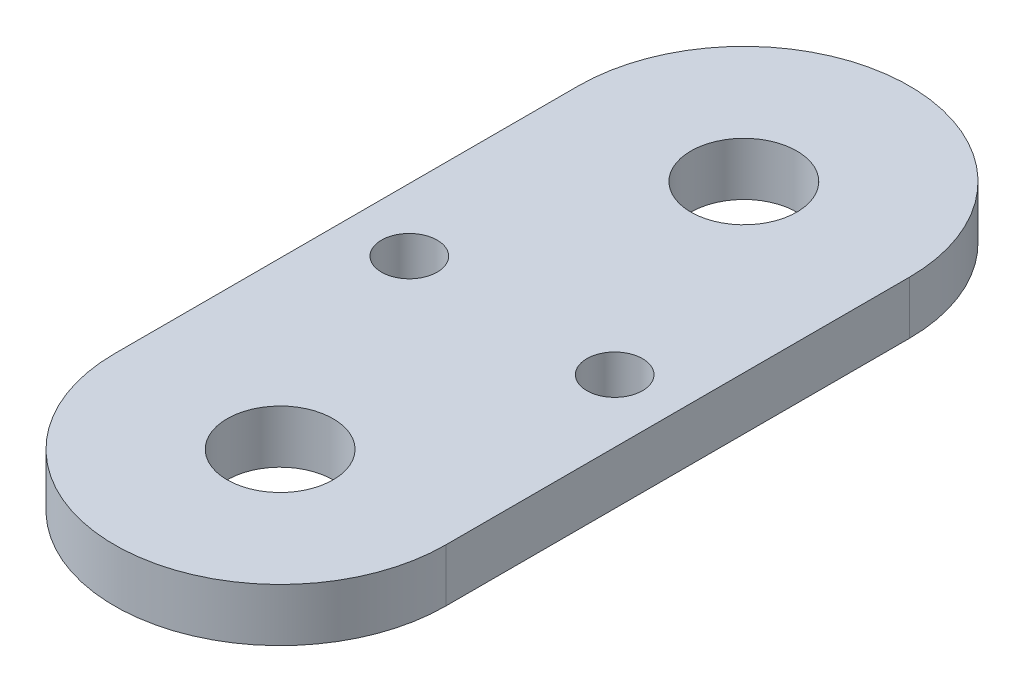
ISO-10303-21;
HEADER;
FILE_DESCRIPTION(('STEP AP214'),'2;1');
FILE_NAME('part.step','',(''),(''),'','','');
FILE_SCHEMA(('AUTOMOTIVE_DESIGN { 1 0 10303 214 1 1 1 1 }'));
ENDSEC;
DATA;
#1=APPLICATION_CONTEXT('core data for automotive mechanical design processes');
#2=APPLICATION_PROTOCOL_DEFINITION('international standard','automotive_design',2000,#1);
#3=PRODUCT_CONTEXT('',#1,'mechanical');
#4=PRODUCT('Part','Part','',(#3));
#5=PRODUCT_RELATED_PRODUCT_CATEGORY('part','',(#4));
#6=PRODUCT_DEFINITION_FORMATION('','',#4);
#7=PRODUCT_DEFINITION_CONTEXT('part definition',#1,'design');
#8=PRODUCT_DEFINITION('design','',#6,#7);
#9=PRODUCT_DEFINITION_SHAPE('','',#8);
#10=(LENGTH_UNIT() NAMED_UNIT(*) SI_UNIT(.MILLI.,.METRE.));
#11=(NAMED_UNIT(*) PLANE_ANGLE_UNIT() SI_UNIT($,.RADIAN.));
#12=(NAMED_UNIT(*) SI_UNIT($,.STERADIAN.) SOLID_ANGLE_UNIT());
#13=UNCERTAINTY_MEASURE_WITH_UNIT(LENGTH_MEASURE(1.E-05),#10,'distance_accuracy_value','');
#14=(GEOMETRIC_REPRESENTATION_CONTEXT(3) GLOBAL_UNCERTAINTY_ASSIGNED_CONTEXT((#13)) GLOBAL_UNIT_ASSIGNED_CONTEXT((#10,
#11,#12)) REPRESENTATION_CONTEXT('',''));
#15=CARTESIAN_POINT('',(0.,0.,0.));
#16=DIRECTION('',(0.,0.,1.));
#17=DIRECTION('',(1.,0.,0.));
#18=AXIS2_PLACEMENT_3D('',#15,#16,#17);
#19=CARTESIAN_POINT('',(0.,4.,-17.5));
#20=DIRECTION('',(0.,-1.,0.));
#21=DIRECTION('',(0.,0.,-1.));
#22=AXIS2_PLACEMENT_3D('',#19,#20,#21);
#23=CYLINDRICAL_SURFACE('',#22,12.5);
#24=CARTESIAN_POINT('',(0.,0.,-17.5));
#25=DIRECTION('',(0.,1.,0.));
#26=DIRECTION('',(0.,0.,1.));
#27=AXIS2_PLACEMENT_3D('',#24,#25,#26);
#28=CIRCLE('',#27,12.5);
#29=CARTESIAN_POINT('',(12.5,0.,-17.5));
#30=VERTEX_POINT('',#29);
#31=CARTESIAN_POINT('',(-12.5,0.,-17.5));
#32=VERTEX_POINT('',#31);
#33=EDGE_CURVE('E118',#30,#32,#28,.T.);
#34=ORIENTED_EDGE('',*,*,#33,.T.);
#35=DIRECTION('',(0.,-1.,0.));
#36=VECTOR('',#35,1.);
#37=CARTESIAN_POINT('',(-12.5,4.,-17.5));
#38=LINE('',#37,#36);
#39=CARTESIAN_POINT('',(-12.5,4.,-17.5));
#40=VERTEX_POINT('',#39);
#41=EDGE_CURVE('E11',#40,#32,#38,.T.);
#42=ORIENTED_EDGE('',*,*,#41,.F.);
#43=CARTESIAN_POINT('',(0.,4.,-17.5));
#44=DIRECTION('',(0.,1.,0.));
#45=DIRECTION('',(0.,0.,1.));
#46=AXIS2_PLACEMENT_3D('',#43,#44,#45);
#47=CIRCLE('',#46,12.5);
#48=CARTESIAN_POINT('',(12.5,4.,-17.5));
#49=VERTEX_POINT('',#48);
#50=EDGE_CURVE('E82',#49,#40,#47,.T.);
#51=ORIENTED_EDGE('',*,*,#50,.F.);
#52=DIRECTION('',(0.,-1.,0.));
#53=VECTOR('',#52,1.);
#54=CARTESIAN_POINT('',(12.5,4.,-17.5));
#55=LINE('',#54,#53);
#56=EDGE_CURVE('E114',#49,#30,#55,.T.);
#57=ORIENTED_EDGE('',*,*,#56,.T.);
#58=EDGE_LOOP('',(#34,#42,#51,#57));
#59=FACE_BOUND('',#58,.T.);
#60=ADVANCED_FACE('F39',(#59),#23,.T.);
#61=CARTESIAN_POINT('',(-12.5,4.,0.));
#62=DIRECTION('',(-1.,0.,0.));
#63=DIRECTION('',(0.,0.,1.));
#64=AXIS2_PLACEMENT_3D('',#61,#62,#63);
#65=PLANE('',#64);
#66=DIRECTION('',(0.,0.,-1.));
#67=VECTOR('',#66,1.);
#68=CARTESIAN_POINT('',(-12.5,0.,0.));
#69=LINE('',#68,#67);
#70=CARTESIAN_POINT('',(-12.5,0.,17.5));
#71=VERTEX_POINT('',#70);
#72=EDGE_CURVE('E92',#71,#32,#69,.T.);
#73=ORIENTED_EDGE('',*,*,#72,.F.);
#74=DIRECTION('',(0.,-1.,0.));
#75=VECTOR('',#74,1.);
#76=CARTESIAN_POINT('',(-12.5,4.,17.5));
#77=LINE('',#76,#75);
#78=CARTESIAN_POINT('',(-12.5,4.,17.5));
#79=VERTEX_POINT('',#78);
#80=EDGE_CURVE('E48',#79,#71,#77,.T.);
#81=ORIENTED_EDGE('',*,*,#80,.F.);
#82=DIRECTION('',(0.,0.,-1.));
#83=VECTOR('',#82,1.);
#84=CARTESIAN_POINT('',(-12.5,4.,0.));
#85=LINE('',#84,#83);
#86=EDGE_CURVE('E90',#79,#40,#85,.T.);
#87=ORIENTED_EDGE('',*,*,#86,.T.);
#88=ORIENTED_EDGE('',*,*,#41,.T.);
#89=EDGE_LOOP('',(#73,#81,#87,#88));
#90=FACE_BOUND('',#89,.T.);
#91=ADVANCED_FACE('F89',(#90),#65,.T.);
#92=CARTESIAN_POINT('',(0.,4.,17.5));
#93=DIRECTION('',(0.,-1.,0.));
#94=DIRECTION('',(0.,0.,-1.));
#95=AXIS2_PLACEMENT_3D('',#92,#93,#94);
#96=CYLINDRICAL_SURFACE('',#95,12.5);
#97=CARTESIAN_POINT('',(0.,0.,17.5));
#98=DIRECTION('',(0.,1.,0.));
#99=DIRECTION('',(0.,0.,1.));
#100=AXIS2_PLACEMENT_3D('',#97,#98,#99);
#101=CIRCLE('',#100,12.5);
#102=CARTESIAN_POINT('',(12.5,0.,17.5));
#103=VERTEX_POINT('',#102);
#104=EDGE_CURVE('E71',#71,#103,#101,.T.);
#105=ORIENTED_EDGE('',*,*,#104,.T.);
#106=DIRECTION('',(0.,-1.,0.));
#107=VECTOR('',#106,1.);
#108=CARTESIAN_POINT('',(12.5,4.,17.5));
#109=LINE('',#108,#107);
#110=CARTESIAN_POINT('',(12.5,4.,17.5));
#111=VERTEX_POINT('',#110);
#112=EDGE_CURVE('E93',#111,#103,#109,.T.);
#113=ORIENTED_EDGE('',*,*,#112,.F.);
#114=CARTESIAN_POINT('',(0.,4.,17.5));
#115=DIRECTION('',(0.,1.,0.));
#116=DIRECTION('',(0.,0.,1.));
#117=AXIS2_PLACEMENT_3D('',#114,#115,#116);
#118=CIRCLE('',#117,12.5);
#119=EDGE_CURVE('E94',#79,#111,#118,.T.);
#120=ORIENTED_EDGE('',*,*,#119,.F.);
#121=ORIENTED_EDGE('',*,*,#80,.T.);
#122=EDGE_LOOP('',(#105,#113,#120,#121));
#123=FACE_BOUND('',#122,.T.);
#124=ADVANCED_FACE('F95',(#123),#96,.T.);
#125=CARTESIAN_POINT('',(-7.75,4.,0.));
#126=DIRECTION('',(0.,-1.,0.));
#127=DIRECTION('',(0.,0.,-1.));
#128=AXIS2_PLACEMENT_3D('',#125,#126,#127);
#129=CYLINDRICAL_SURFACE('',#128,2.1);
#130=CARTESIAN_POINT('',(-7.75,4.,0.));
#131=DIRECTION('',(0.,1.,0.));
#132=DIRECTION('',(0.,0.,1.));
#133=AXIS2_PLACEMENT_3D('',#130,#131,#132);
#134=CIRCLE('',#133,2.1);
#135=CARTESIAN_POINT('',(-7.75,4.,2.1));
#136=VERTEX_POINT('',#135);
#137=EDGE_CURVE('E108',#136,#136,#134,.T.);
#138=ORIENTED_EDGE('',*,*,#137,.T.);
#139=EDGE_LOOP('',(#138));
#140=FACE_BOUND('',#139,.T.);
#141=CARTESIAN_POINT('',(-7.75,0.,0.));
#142=DIRECTION('',(0.,1.,0.));
#143=DIRECTION('',(0.,0.,1.));
#144=AXIS2_PLACEMENT_3D('',#141,#142,#143);
#145=CIRCLE('',#144,2.1);
#146=CARTESIAN_POINT('',(-7.75,0.,2.1));
#147=VERTEX_POINT('',#146);
#148=EDGE_CURVE('E127',#147,#147,#145,.T.);
#149=ORIENTED_EDGE('',*,*,#148,.F.);
#150=EDGE_LOOP('',(#149));
#151=FACE_BOUND('',#150,.T.);
#152=ADVANCED_FACE('F148',(#140,#151),#129,.F.);
#153=CARTESIAN_POINT('',(7.75,4.,0.));
#154=DIRECTION('',(0.,-1.,0.));
#155=DIRECTION('',(0.,0.,-1.));
#156=AXIS2_PLACEMENT_3D('',#153,#154,#155);
#157=CYLINDRICAL_SURFACE('',#156,2.1);
#158=CARTESIAN_POINT('',(7.75,4.,0.));
#159=DIRECTION('',(0.,1.,0.));
#160=DIRECTION('',(0.,0.,1.));
#161=AXIS2_PLACEMENT_3D('',#158,#159,#160);
#162=CIRCLE('',#161,2.1);
#163=CARTESIAN_POINT('',(7.75,4.,2.1));
#164=VERTEX_POINT('',#163);
#165=EDGE_CURVE('E105',#164,#164,#162,.T.);
#166=ORIENTED_EDGE('',*,*,#165,.T.);
#167=EDGE_LOOP('',(#166));
#168=FACE_BOUND('',#167,.T.);
#169=CARTESIAN_POINT('',(7.75,0.,0.));
#170=DIRECTION('',(0.,1.,0.));
#171=DIRECTION('',(0.,0.,1.));
#172=AXIS2_PLACEMENT_3D('',#169,#170,#171);
#173=CIRCLE('',#172,2.1);
#174=CARTESIAN_POINT('',(7.75,0.,2.1));
#175=VERTEX_POINT('',#174);
#176=EDGE_CURVE('E124',#175,#175,#173,.T.);
#177=ORIENTED_EDGE('',*,*,#176,.F.);
#178=EDGE_LOOP('',(#177));
#179=FACE_BOUND('',#178,.T.);
#180=ADVANCED_FACE('F151',(#168,#179),#157,.F.);
#181=CARTESIAN_POINT('',(12.5,4.,0.));
#182=DIRECTION('',(-1.,0.,0.));
#183=DIRECTION('',(0.,0.,1.));
#184=AXIS2_PLACEMENT_3D('',#181,#182,#183);
#185=PLANE('',#184);
#186=DIRECTION('',(0.,0.,-1.));
#187=VECTOR('',#186,1.);
#188=CARTESIAN_POINT('',(12.5,0.,0.));
#189=LINE('',#188,#187);
#190=EDGE_CURVE('E77',#103,#30,#189,.T.);
#191=ORIENTED_EDGE('',*,*,#190,.T.);
#192=ORIENTED_EDGE('',*,*,#56,.F.);
#193=DIRECTION('',(0.,0.,-1.));
#194=VECTOR('',#193,1.);
#195=CARTESIAN_POINT('',(12.5,4.,0.));
#196=LINE('',#195,#194);
#197=EDGE_CURVE('E56',#111,#49,#196,.T.);
#198=ORIENTED_EDGE('',*,*,#197,.F.);
#199=ORIENTED_EDGE('',*,*,#112,.T.);
#200=EDGE_LOOP('',(#191,#192,#198,#199));
#201=FACE_BOUND('',#200,.T.);
#202=ADVANCED_FACE('F134',(#201),#185,.F.);
#203=CARTESIAN_POINT('',(0.,4.,-17.5));
#204=DIRECTION('',(0.,-1.,0.));
#205=DIRECTION('',(0.,0.,-1.));
#206=AXIS2_PLACEMENT_3D('',#203,#204,#205);
#207=CYLINDRICAL_SURFACE('',#206,4.);
#208=CARTESIAN_POINT('',(0.,4.,-17.5));
#209=DIRECTION('',(0.,1.,0.));
#210=DIRECTION('',(0.,0.,1.));
#211=AXIS2_PLACEMENT_3D('',#208,#209,#210);
#212=CIRCLE('',#211,4.);
#213=CARTESIAN_POINT('',(0.,4.,-13.5));
#214=VERTEX_POINT('',#213);
#215=EDGE_CURVE('E100',#214,#214,#212,.T.);
#216=ORIENTED_EDGE('',*,*,#215,.T.);
#217=EDGE_LOOP('',(#216));
#218=FACE_BOUND('',#217,.T.);
#219=CARTESIAN_POINT('',(0.,0.,-17.5));
#220=DIRECTION('',(0.,1.,0.));
#221=DIRECTION('',(0.,0.,1.));
#222=AXIS2_PLACEMENT_3D('',#219,#220,#221);
#223=CIRCLE('',#222,4.);
#224=CARTESIAN_POINT('',(0.,0.,-13.5));
#225=VERTEX_POINT('',#224);
#226=EDGE_CURVE('E115',#225,#225,#223,.T.);
#227=ORIENTED_EDGE('',*,*,#226,.F.);
#228=EDGE_LOOP('',(#227));
#229=FACE_BOUND('',#228,.T.);
#230=ADVANCED_FACE('F41',(#218,#229),#207,.F.);
#231=CARTESIAN_POINT('',(0.,4.,17.5));
#232=DIRECTION('',(0.,-1.,0.));
#233=DIRECTION('',(0.,0.,-1.));
#234=AXIS2_PLACEMENT_3D('',#231,#232,#233);
#235=CYLINDRICAL_SURFACE('',#234,4.);
#236=CARTESIAN_POINT('',(0.,4.,17.5));
#237=DIRECTION('',(0.,1.,0.));
#238=DIRECTION('',(0.,0.,1.));
#239=AXIS2_PLACEMENT_3D('',#236,#237,#238);
#240=CIRCLE('',#239,4.);
#241=CARTESIAN_POINT('',(0.,4.,21.5));
#242=VERTEX_POINT('',#241);
#243=EDGE_CURVE('E111',#242,#242,#240,.T.);
#244=ORIENTED_EDGE('',*,*,#243,.T.);
#245=EDGE_LOOP('',(#244));
#246=FACE_BOUND('',#245,.T.);
#247=CARTESIAN_POINT('',(0.,0.,17.5));
#248=DIRECTION('',(0.,1.,0.));
#249=DIRECTION('',(0.,0.,1.));
#250=AXIS2_PLACEMENT_3D('',#247,#248,#249);
#251=CIRCLE('',#250,4.);
#252=CARTESIAN_POINT('',(0.,0.,21.5));
#253=VERTEX_POINT('',#252);
#254=EDGE_CURVE('E130',#253,#253,#251,.T.);
#255=ORIENTED_EDGE('',*,*,#254,.F.);
#256=EDGE_LOOP('',(#255));
#257=FACE_BOUND('',#256,.T.);
#258=ADVANCED_FACE('F158',(#246,#257),#235,.F.);
#259=CARTESIAN_POINT('',(0.,4.,0.));
#260=DIRECTION('',(0.,1.,0.));
#261=DIRECTION('',(0.,0.,1.));
#262=AXIS2_PLACEMENT_3D('',#259,#260,#261);
#263=PLANE('',#262);
#264=ORIENTED_EDGE('',*,*,#215,.F.);
#265=EDGE_LOOP('',(#264));
#266=FACE_BOUND('',#265,.T.);
#267=ORIENTED_EDGE('',*,*,#50,.T.);
#268=ORIENTED_EDGE('',*,*,#86,.F.);
#269=ORIENTED_EDGE('',*,*,#119,.T.);
#270=ORIENTED_EDGE('',*,*,#197,.T.);
#271=EDGE_LOOP('',(#267,#268,#269,#270));
#272=FACE_BOUND('',#271,.T.);
#273=ORIENTED_EDGE('',*,*,#165,.F.);
#274=EDGE_LOOP('',(#273));
#275=FACE_BOUND('',#274,.T.);
#276=ORIENTED_EDGE('',*,*,#137,.F.);
#277=EDGE_LOOP('',(#276));
#278=FACE_BOUND('',#277,.T.);
#279=ORIENTED_EDGE('',*,*,#243,.F.);
#280=EDGE_LOOP('',(#279));
#281=FACE_BOUND('',#280,.T.);
#282=ADVANCED_FACE('F97',(#266,#272,#275,#278,#281),#263,.T.);
#283=CARTESIAN_POINT('',(0.,0.,0.));
#284=DIRECTION('',(0.,1.,0.));
#285=DIRECTION('',(0.,0.,1.));
#286=AXIS2_PLACEMENT_3D('',#283,#284,#285);
#287=PLANE('',#286);
#288=ORIENTED_EDGE('',*,*,#226,.T.);
#289=EDGE_LOOP('',(#288));
#290=FACE_BOUND('',#289,.T.);
#291=ORIENTED_EDGE('',*,*,#33,.F.);
#292=ORIENTED_EDGE('',*,*,#190,.F.);
#293=ORIENTED_EDGE('',*,*,#104,.F.);
#294=ORIENTED_EDGE('',*,*,#72,.T.);
#295=EDGE_LOOP('',(#291,#292,#293,#294));
#296=FACE_BOUND('',#295,.T.);
#297=ORIENTED_EDGE('',*,*,#176,.T.);
#298=EDGE_LOOP('',(#297));
#299=FACE_BOUND('',#298,.T.);
#300=ORIENTED_EDGE('',*,*,#148,.T.);
#301=EDGE_LOOP('',(#300));
#302=FACE_BOUND('',#301,.T.);
#303=ORIENTED_EDGE('',*,*,#254,.T.);
#304=EDGE_LOOP('',(#303));
#305=FACE_BOUND('',#304,.T.);
#306=ADVANCED_FACE('F137',(#290,#296,#299,#302,#305),#287,.F.);
#307=CLOSED_SHELL('',(#60,#91,#124,#152,#180,#202,#230,#258,#282,#306));
#308=MANIFOLD_SOLID_BREP('B2',#307);
#309=ADVANCED_BREP_SHAPE_REPRESENTATION('',(#18,#308),#14);
#310=SHAPE_DEFINITION_REPRESENTATION(#9,#309);
ENDSEC;
END-ISO-10303-21;
